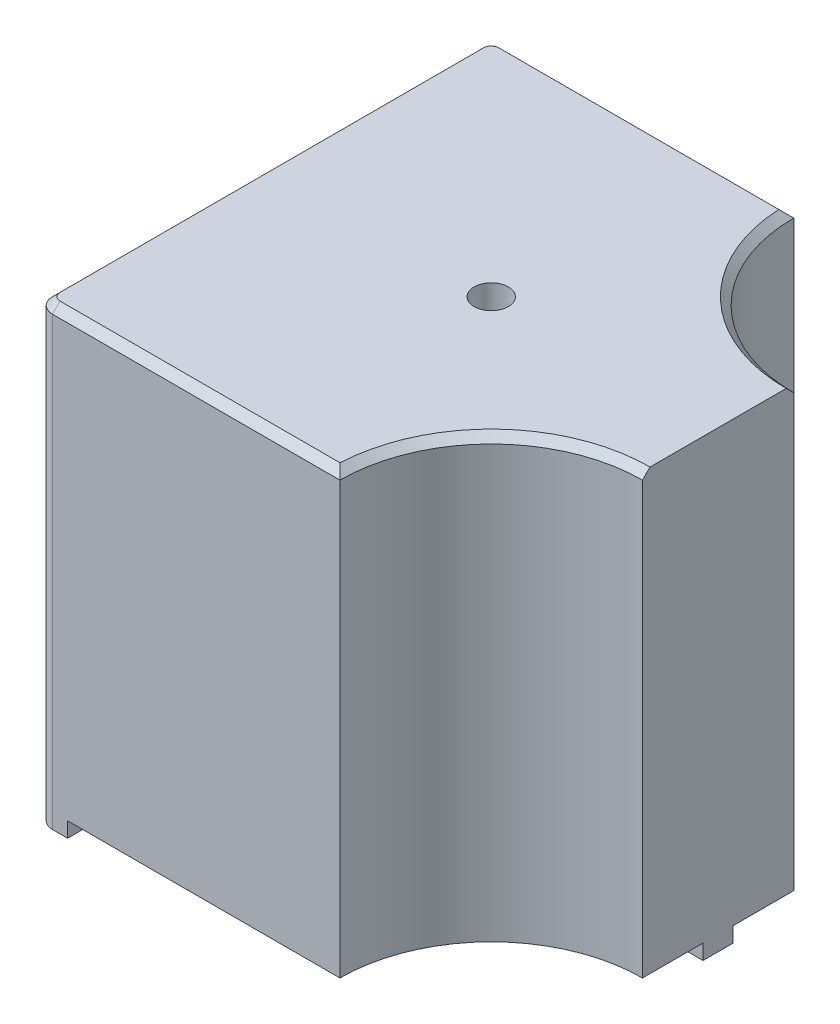
ISO-10303-21;
HEADER;
FILE_DESCRIPTION(('STEP AP214'),'2;1');
FILE_NAME('part.step','',(''),(''),'','','');
FILE_SCHEMA(('AUTOMOTIVE_DESIGN { 1 0 10303 214 1 1 1 1 }'));
ENDSEC;
DATA;
#1=APPLICATION_CONTEXT('core data for automotive mechanical design processes');
#2=APPLICATION_PROTOCOL_DEFINITION('international standard','automotive_design',2000,#1);
#3=PRODUCT_CONTEXT('',#1,'mechanical');
#4=PRODUCT('Part','Part','',(#3));
#5=PRODUCT_RELATED_PRODUCT_CATEGORY('part','',(#4));
#6=PRODUCT_DEFINITION_FORMATION('','',#4);
#7=PRODUCT_DEFINITION_CONTEXT('part definition',#1,'design');
#8=PRODUCT_DEFINITION('design','',#6,#7);
#9=PRODUCT_DEFINITION_SHAPE('','',#8);
#10=(LENGTH_UNIT() NAMED_UNIT(*) SI_UNIT(.MILLI.,.METRE.));
#11=(NAMED_UNIT(*) PLANE_ANGLE_UNIT() SI_UNIT($,.RADIAN.));
#12=(NAMED_UNIT(*) SI_UNIT($,.STERADIAN.) SOLID_ANGLE_UNIT());
#13=UNCERTAINTY_MEASURE_WITH_UNIT(LENGTH_MEASURE(1.E-05),#10,'distance_accuracy_value','');
#14=(GEOMETRIC_REPRESENTATION_CONTEXT(3) GLOBAL_UNCERTAINTY_ASSIGNED_CONTEXT((#13)) GLOBAL_UNIT_ASSIGNED_CONTEXT((#10,
#11,#12)) REPRESENTATION_CONTEXT('',''));
#15=CARTESIAN_POINT('',(0.,0.,0.));
#16=DIRECTION('',(0.,0.,1.));
#17=DIRECTION('',(1.,0.,0.));
#18=AXIS2_PLACEMENT_3D('',#15,#16,#17);
#19=CARTESIAN_POINT('',(15.,30.,-15.));
#20=DIRECTION('',(-1.,0.,0.));
#21=DIRECTION('',(0.,0.,1.));
#22=AXIS2_PLACEMENT_3D('',#19,#20,#21);
#23=PLANE('',#22);
#24=DIRECTION('',(0.,-1.,0.));
#25=VECTOR('',#24,1.);
#26=CARTESIAN_POINT('',(15.,132.451905283833,-5.));
#27=LINE('',#26,#25);
#28=CARTESIAN_POINT('',(15.,29.5,-5.));
#29=VERTEX_POINT('',#28);
#30=CARTESIAN_POINT('',(15.,1.,-5.));
#31=VERTEX_POINT('',#30);
#32=EDGE_CURVE('E303',#29,#31,#27,.T.);
#33=ORIENTED_EDGE('',*,*,#32,.F.);
#34=DIRECTION('',(0.,0.707106781186545,0.70710678118655));
#35=VECTOR('',#34,1.);
#36=CARTESIAN_POINT('',(15.,19.5000000000001,-15.));
#37=LINE('',#36,#35);
#38=CARTESIAN_POINT('',(15.,30.,-4.5));
#39=VERTEX_POINT('',#38);
#40=EDGE_CURVE('E344',#29,#39,#37,.T.);
#41=ORIENTED_EDGE('',*,*,#40,.T.);
#42=DIRECTION('',(0.,0.,-1.));
#43=VECTOR('',#42,1.);
#44=CARTESIAN_POINT('',(15.,30.,-15.));
#45=LINE('',#44,#43);
#46=CARTESIAN_POINT('',(15.,30.,4.5));
#47=VERTEX_POINT('',#46);
#48=EDGE_CURVE('E309',#47,#39,#45,.T.);
#49=ORIENTED_EDGE('',*,*,#48,.F.);
#50=DIRECTION('',(0.,-0.707106781186547,0.707106781186548));
#51=VECTOR('',#50,1.);
#52=CARTESIAN_POINT('',(15.,19.5,15.));
#53=LINE('',#52,#51);
#54=CARTESIAN_POINT('',(15.,29.5,5.));
#55=VERTEX_POINT('',#54);
#56=EDGE_CURVE('E342',#47,#55,#53,.T.);
#57=ORIENTED_EDGE('',*,*,#56,.T.);
#58=DIRECTION('',(0.,-1.,0.));
#59=VECTOR('',#58,1.);
#60=CARTESIAN_POINT('',(15.,132.451905283833,5.));
#61=LINE('',#60,#59);
#62=CARTESIAN_POINT('',(15.,1.00000000000006,5.));
#63=VERTEX_POINT('',#62);
#64=EDGE_CURVE('E300',#55,#63,#61,.T.);
#65=ORIENTED_EDGE('',*,*,#64,.T.);
#66=DIRECTION('',(0.,0.,1.));
#67=VECTOR('',#66,1.);
#68=CARTESIAN_POINT('',(15.,1.,-15.));
#69=LINE('',#68,#67);
#70=CARTESIAN_POINT('',(15.,1.,1.));
#71=VERTEX_POINT('',#70);
#72=EDGE_CURVE('E288',#71,#63,#69,.T.);
#73=ORIENTED_EDGE('',*,*,#72,.F.);
#74=DIRECTION('',(0.,-1.,0.));
#75=VECTOR('',#74,1.);
#76=CARTESIAN_POINT('',(15.,1.,1.));
#77=LINE('',#76,#75);
#78=CARTESIAN_POINT('',(15.,0.,1.));
#79=VERTEX_POINT('',#78);
#80=EDGE_CURVE('E230',#71,#79,#77,.T.);
#81=ORIENTED_EDGE('',*,*,#80,.T.);
#82=DIRECTION('',(0.,0.,-1.));
#83=VECTOR('',#82,1.);
#84=CARTESIAN_POINT('',(15.,0.,-15.));
#85=LINE('',#84,#83);
#86=CARTESIAN_POINT('',(15.,0.,-0.999999999999997));
#87=VERTEX_POINT('',#86);
#88=EDGE_CURVE('E307',#79,#87,#85,.T.);
#89=ORIENTED_EDGE('',*,*,#88,.T.);
#90=DIRECTION('',(0.,-1.,0.));
#91=VECTOR('',#90,1.);
#92=CARTESIAN_POINT('',(15.,1.,-0.999999999999997));
#93=LINE('',#92,#91);
#94=CARTESIAN_POINT('',(15.,1.,-0.999999999999997));
#95=VERTEX_POINT('',#94);
#96=EDGE_CURVE('E238',#95,#87,#93,.T.);
#97=ORIENTED_EDGE('',*,*,#96,.F.);
#98=EDGE_CURVE('E292',#31,#95,#69,.T.);
#99=ORIENTED_EDGE('',*,*,#98,.F.);
#100=EDGE_LOOP('',(#33,#41,#49,#57,#65,#73,#81,#89,#97,#99));
#101=FACE_BOUND('',#100,.T.);
#102=ADVANCED_FACE('F41',(#101),#23,.F.);
#103=CARTESIAN_POINT('',(0.,0.,0.));
#104=DIRECTION('',(0.,1.,0.));
#105=DIRECTION('',(0.,0.,1.));
#106=AXIS2_PLACEMENT_3D('',#103,#104,#105);
#107=PLANE('',#106);
#108=DIRECTION('',(1.,0.,0.));
#109=VECTOR('',#108,1.);
#110=CARTESIAN_POINT('',(-15.,0.,15.));
#111=LINE('',#110,#109);
#112=CARTESIAN_POINT('',(-13.999999968,0.,15.));
#113=VERTEX_POINT('',#112);
#114=CARTESIAN_POINT('',(-13.,0.,15.));
#115=VERTEX_POINT('',#114);
#116=EDGE_CURVE('E313',#113,#115,#111,.T.);
#117=ORIENTED_EDGE('',*,*,#116,.F.);
#118=CARTESIAN_POINT('',(-13.999999968,0.,13.999999968));
#119=DIRECTION('',(0.,1.,0.));
#120=DIRECTION('',(0.,0.,1.));
#121=AXIS2_PLACEMENT_3D('',#118,#119,#120);
#122=CIRCLE('',#121,1.000000032);
#123=CARTESIAN_POINT('',(-15.,0.,13.999999968));
#124=VERTEX_POINT('',#123);
#125=EDGE_CURVE('E327',#113,#124,#122,.F.);
#126=ORIENTED_EDGE('',*,*,#125,.T.);
#127=DIRECTION('',(0.,0.,1.));
#128=VECTOR('',#127,1.);
#129=CARTESIAN_POINT('',(-15.,0.,-15.));
#130=LINE('',#129,#128);
#131=CARTESIAN_POINT('',(-15.,0.,13.));
#132=VERTEX_POINT('',#131);
#133=EDGE_CURVE('E319',#132,#124,#130,.T.);
#134=ORIENTED_EDGE('',*,*,#133,.F.);
#135=DIRECTION('',(1.,0.,0.));
#136=VECTOR('',#135,1.);
#137=CARTESIAN_POINT('',(-15.,0.,13.));
#138=LINE('',#137,#136);
#139=CARTESIAN_POINT('',(-13.,0.,13.));
#140=VERTEX_POINT('',#139);
#141=EDGE_CURVE('E262',#132,#140,#138,.T.);
#142=ORIENTED_EDGE('',*,*,#141,.T.);
#143=DIRECTION('',(0.,0.,1.));
#144=VECTOR('',#143,1.);
#145=CARTESIAN_POINT('',(-13.,0.,15.));
#146=LINE('',#145,#144);
#147=EDGE_CURVE('E271',#140,#115,#146,.T.);
#148=ORIENTED_EDGE('',*,*,#147,.T.);
#149=EDGE_LOOP('',(#117,#126,#134,#142,#148));
#150=FACE_BOUND('',#149,.T.);
#151=ADVANCED_FACE('F409',(#150),#107,.F.);
#152=CARTESIAN_POINT('',(-15.,0.,-13.999999968));
#153=VERTEX_POINT('',#152);
#154=CARTESIAN_POINT('',(-15.,0.,-13.));
#155=VERTEX_POINT('',#154);
#156=EDGE_CURVE('E320',#153,#155,#130,.T.);
#157=ORIENTED_EDGE('',*,*,#156,.F.);
#158=CARTESIAN_POINT('',(-13.999999968,0.,-13.999999968));
#159=DIRECTION('',(0.,1.,0.));
#160=DIRECTION('',(0.,0.,1.));
#161=AXIS2_PLACEMENT_3D('',#158,#159,#160);
#162=CIRCLE('',#161,1.000000032);
#163=CARTESIAN_POINT('',(-13.999999968,0.,-15.));
#164=VERTEX_POINT('',#163);
#165=EDGE_CURVE('E334',#153,#164,#162,.F.);
#166=ORIENTED_EDGE('',*,*,#165,.T.);
#167=DIRECTION('',(-1.,0.,0.));
#168=VECTOR('',#167,1.);
#169=CARTESIAN_POINT('',(-15.,0.,-15.));
#170=LINE('',#169,#168);
#171=CARTESIAN_POINT('',(-13.,0.,-15.));
#172=VERTEX_POINT('',#171);
#173=EDGE_CURVE('E316',#172,#164,#170,.T.);
#174=ORIENTED_EDGE('',*,*,#173,.F.);
#175=DIRECTION('',(0.,0.,1.));
#176=VECTOR('',#175,1.);
#177=CARTESIAN_POINT('',(-13.,0.,-15.));
#178=LINE('',#177,#176);
#179=CARTESIAN_POINT('',(-13.,0.,-13.));
#180=VERTEX_POINT('',#179);
#181=EDGE_CURVE('E240',#172,#180,#178,.T.);
#182=ORIENTED_EDGE('',*,*,#181,.T.);
#183=DIRECTION('',(-1.,0.,0.));
#184=VECTOR('',#183,1.);
#185=CARTESIAN_POINT('',(-15.,0.,-13.));
#186=LINE('',#185,#184);
#187=EDGE_CURVE('E251',#180,#155,#186,.T.);
#188=ORIENTED_EDGE('',*,*,#187,.T.);
#189=EDGE_LOOP('',(#157,#166,#174,#182,#188));
#190=FACE_BOUND('',#189,.T.);
#191=ADVANCED_FACE('F415',(#190),#107,.F.);
#192=DIRECTION('',(1.,0.,0.));
#193=VECTOR('',#192,1.);
#194=CARTESIAN_POINT('',(15.,0.,-0.999999999999997));
#195=LINE('',#194,#193);
#196=CARTESIAN_POINT('',(13.,0.,-0.999999999999998));
#197=VERTEX_POINT('',#196);
#198=EDGE_CURVE('E224',#197,#87,#195,.T.);
#199=ORIENTED_EDGE('',*,*,#198,.T.);
#200=ORIENTED_EDGE('',*,*,#88,.F.);
#201=DIRECTION('',(-1.,0.,0.));
#202=VECTOR('',#201,1.);
#203=CARTESIAN_POINT('',(15.,0.,1.));
#204=LINE('',#203,#202);
#205=CARTESIAN_POINT('',(13.,0.,1.));
#206=VERTEX_POINT('',#205);
#207=EDGE_CURVE('E219',#79,#206,#204,.T.);
#208=ORIENTED_EDGE('',*,*,#207,.T.);
#209=DIRECTION('',(0.,0.,-1.));
#210=VECTOR('',#209,1.);
#211=CARTESIAN_POINT('',(13.,0.,1.));
#212=LINE('',#211,#210);
#213=EDGE_CURVE('E233',#206,#197,#212,.T.);
#214=ORIENTED_EDGE('',*,*,#213,.T.);
#215=EDGE_LOOP('',(#199,#200,#208,#214));
#216=FACE_BOUND('',#215,.T.);
#217=ADVANCED_FACE('F418',(#216),#107,.F.);
#218=CARTESIAN_POINT('',(-15.,30.,-15.));
#219=DIRECTION('',(0.,0.,1.));
#220=DIRECTION('',(1.,0.,0.));
#221=AXIS2_PLACEMENT_3D('',#218,#219,#220);
#222=PLANE('',#221);
#223=DIRECTION('',(0.,-1.,0.));
#224=VECTOR('',#223,1.);
#225=CARTESIAN_POINT('',(-13.999999968,30.,-15.));
#226=LINE('',#225,#224);
#227=CARTESIAN_POINT('',(-13.999999968,29.5,-15.));
#228=VERTEX_POINT('',#227);
#229=EDGE_CURVE('E336',#164,#228,#226,.F.);
#230=ORIENTED_EDGE('',*,*,#229,.T.);
#231=DIRECTION('',(1.,0.,0.));
#232=VECTOR('',#231,1.);
#233=CARTESIAN_POINT('',(5.,29.5,-15.));
#234=LINE('',#233,#232);
#235=CARTESIAN_POINT('',(5.,29.5,-15.));
#236=VERTEX_POINT('',#235);
#237=EDGE_CURVE('E360',#228,#236,#234,.T.);
#238=ORIENTED_EDGE('',*,*,#237,.T.);
#239=DIRECTION('',(0.,-1.,0.));
#240=VECTOR('',#239,1.);
#241=CARTESIAN_POINT('',(5.,132.451905283833,-15.));
#242=LINE('',#241,#240);
#243=CARTESIAN_POINT('',(5.,1.,-15.));
#244=VERTEX_POINT('',#243);
#245=EDGE_CURVE('E305',#236,#244,#242,.T.);
#246=ORIENTED_EDGE('',*,*,#245,.T.);
#247=DIRECTION('',(1.,0.,0.));
#248=VECTOR('',#247,1.);
#249=CARTESIAN_POINT('',(-15.,1.,-15.));
#250=LINE('',#249,#248);
#251=CARTESIAN_POINT('',(-13.,1.,-15.));
#252=VERTEX_POINT('',#251);
#253=EDGE_CURVE('E295',#252,#244,#250,.T.);
#254=ORIENTED_EDGE('',*,*,#253,.F.);
#255=DIRECTION('',(0.,-1.,0.));
#256=VECTOR('',#255,1.);
#257=CARTESIAN_POINT('',(-13.,1.,-15.));
#258=LINE('',#257,#256);
#259=EDGE_CURVE('E254',#252,#172,#258,.T.);
#260=ORIENTED_EDGE('',*,*,#259,.T.);
#261=ORIENTED_EDGE('',*,*,#173,.T.);
#262=EDGE_LOOP('',(#230,#238,#246,#254,#260,#261));
#263=FACE_BOUND('',#262,.T.);
#264=ADVANCED_FACE('F422',(#263),#222,.F.);
#265=CARTESIAN_POINT('',(15.,132.451905283833,-15.));
#266=DIRECTION('',(0.,-1.,0.));
#267=DIRECTION('',(0.,0.,-1.));
#268=AXIS2_PLACEMENT_3D('',#265,#266,#267);
#269=CYLINDRICAL_SURFACE('',#268,10.);
#270=ORIENTED_EDGE('',*,*,#245,.F.);
#271=CARTESIAN_POINT('',(15.,29.5,-15.));
#272=DIRECTION('',(0.,1.,0.));
#273=DIRECTION('',(0.,0.,1.));
#274=AXIS2_PLACEMENT_3D('',#271,#272,#273);
#275=CIRCLE('',#274,10.);
#276=EDGE_CURVE('E339',#236,#29,#275,.T.);
#277=ORIENTED_EDGE('',*,*,#276,.T.);
#278=ORIENTED_EDGE('',*,*,#32,.T.);
#279=CARTESIAN_POINT('',(15.,1.,-15.));
#280=DIRECTION('',(0.,-1.,0.));
#281=DIRECTION('',(0.,0.,-1.));
#282=AXIS2_PLACEMENT_3D('',#279,#280,#281);
#283=CIRCLE('',#282,10.);
#284=EDGE_CURVE('E291',#244,#31,#283,.F.);
#285=ORIENTED_EDGE('',*,*,#284,.F.);
#286=EDGE_LOOP('',(#270,#277,#278,#285));
#287=FACE_BOUND('',#286,.T.);
#288=ADVANCED_FACE('F457',(#287),#269,.F.);
#289=CARTESIAN_POINT('',(15.,132.451905283833,15.));
#290=DIRECTION('',(0.,-1.,0.));
#291=DIRECTION('',(0.,0.,-1.));
#292=AXIS2_PLACEMENT_3D('',#289,#290,#291);
#293=CYLINDRICAL_SURFACE('',#292,10.);
#294=ORIENTED_EDGE('',*,*,#64,.F.);
#295=CARTESIAN_POINT('',(15.,29.5,15.));
#296=DIRECTION('',(0.,1.,0.));
#297=DIRECTION('',(0.,0.,1.));
#298=AXIS2_PLACEMENT_3D('',#295,#296,#297);
#299=CIRCLE('',#298,10.);
#300=CARTESIAN_POINT('',(5.,29.5,15.));
#301=VERTEX_POINT('',#300);
#302=EDGE_CURVE('E54',#55,#301,#299,.T.);
#303=ORIENTED_EDGE('',*,*,#302,.T.);
#304=DIRECTION('',(0.,-1.,0.));
#305=VECTOR('',#304,1.);
#306=CARTESIAN_POINT('',(5.,132.451905283833,15.));
#307=LINE('',#306,#305);
#308=CARTESIAN_POINT('',(5.,1.,15.));
#309=VERTEX_POINT('',#308);
#310=EDGE_CURVE('E301',#301,#309,#307,.T.);
#311=ORIENTED_EDGE('',*,*,#310,.T.);
#312=CARTESIAN_POINT('',(15.,1.,15.));
#313=DIRECTION('',(0.,-1.,0.));
#314=DIRECTION('',(0.,0.,-1.));
#315=AXIS2_PLACEMENT_3D('',#312,#313,#314);
#316=CIRCLE('',#315,10.);
#317=EDGE_CURVE('E312',#309,#63,#316,.T.);
#318=ORIENTED_EDGE('',*,*,#317,.T.);
#319=EDGE_LOOP('',(#294,#303,#311,#318));
#320=FACE_BOUND('',#319,.T.);
#321=ADVANCED_FACE('F478',(#320),#293,.F.);
#322=CARTESIAN_POINT('',(-15.,30.,15.));
#323=DIRECTION('',(0.,0.,-1.));
#324=DIRECTION('',(-1.,0.,0.));
#325=AXIS2_PLACEMENT_3D('',#322,#323,#324);
#326=PLANE('',#325);
#327=ORIENTED_EDGE('',*,*,#310,.F.);
#328=DIRECTION('',(-1.,0.,0.));
#329=VECTOR('',#328,1.);
#330=CARTESIAN_POINT('',(-13.999999968,29.5,15.));
#331=LINE('',#330,#329);
#332=CARTESIAN_POINT('',(-13.999999968,29.5,15.));
#333=VERTEX_POINT('',#332);
#334=EDGE_CURVE('E12',#301,#333,#331,.T.);
#335=ORIENTED_EDGE('',*,*,#334,.T.);
#336=DIRECTION('',(0.,-1.,0.));
#337=VECTOR('',#336,1.);
#338=CARTESIAN_POINT('',(-13.999999968,30.,15.));
#339=LINE('',#338,#337);
#340=EDGE_CURVE('E325',#333,#113,#339,.T.);
#341=ORIENTED_EDGE('',*,*,#340,.T.);
#342=ORIENTED_EDGE('',*,*,#116,.T.);
#343=DIRECTION('',(0.,-1.,0.));
#344=VECTOR('',#343,1.);
#345=CARTESIAN_POINT('',(-13.,1.,15.));
#346=LINE('',#345,#344);
#347=CARTESIAN_POINT('',(-13.,1.,15.));
#348=VERTEX_POINT('',#347);
#349=EDGE_CURVE('E279',#348,#115,#346,.T.);
#350=ORIENTED_EDGE('',*,*,#349,.F.);
#351=DIRECTION('',(-1.,0.,0.));
#352=VECTOR('',#351,1.);
#353=CARTESIAN_POINT('',(-15.,1.,15.));
#354=LINE('',#353,#352);
#355=EDGE_CURVE('E282',#309,#348,#354,.T.);
#356=ORIENTED_EDGE('',*,*,#355,.F.);
#357=EDGE_LOOP('',(#327,#335,#341,#342,#350,#356));
#358=FACE_BOUND('',#357,.T.);
#359=ADVANCED_FACE('F497',(#358),#326,.F.);
#360=CARTESIAN_POINT('',(0.,30.,0.));
#361=DIRECTION('',(0.,1.,0.));
#362=DIRECTION('',(0.,0.,1.));
#363=AXIS2_PLACEMENT_3D('',#360,#361,#362);
#364=PLANE('',#363);
#365=ORIENTED_EDGE('',*,*,#48,.T.);
#366=CARTESIAN_POINT('',(15.,30.,-15.));
#367=DIRECTION('',(0.,1.,0.));
#368=DIRECTION('',(0.,0.,1.));
#369=AXIS2_PLACEMENT_3D('',#366,#367,#368);
#370=CIRCLE('',#369,10.5);
#371=CARTESIAN_POINT('',(4.51191151829848,30.,-14.5));
#372=VERTEX_POINT('',#371);
#373=EDGE_CURVE('E358',#39,#372,#370,.F.);
#374=ORIENTED_EDGE('',*,*,#373,.T.);
#375=DIRECTION('',(-1.,0.,0.));
#376=VECTOR('',#375,1.);
#377=CARTESIAN_POINT('',(-13.999999968,30.,-14.5));
#378=LINE('',#377,#376);
#379=CARTESIAN_POINT('',(-13.999999968,30.,-14.5));
#380=VERTEX_POINT('',#379);
#381=EDGE_CURVE('E356',#372,#380,#378,.T.);
#382=ORIENTED_EDGE('',*,*,#381,.T.);
#383=CARTESIAN_POINT('',(-13.999999968,30.,-13.999999968));
#384=DIRECTION('',(0.,1.,0.));
#385=DIRECTION('',(0.,0.,1.));
#386=AXIS2_PLACEMENT_3D('',#383,#384,#385);
#387=CIRCLE('',#386,0.500000032);
#388=CARTESIAN_POINT('',(-14.5,30.,-13.999999968));
#389=VERTEX_POINT('',#388);
#390=EDGE_CURVE('E354',#380,#389,#387,.T.);
#391=ORIENTED_EDGE('',*,*,#390,.T.);
#392=DIRECTION('',(0.,0.,1.));
#393=VECTOR('',#392,1.);
#394=CARTESIAN_POINT('',(-14.5,30.,13.999999968));
#395=LINE('',#394,#393);
#396=CARTESIAN_POINT('',(-14.5,30.,13.999999968));
#397=VERTEX_POINT('',#396);
#398=EDGE_CURVE('E352',#389,#397,#395,.T.);
#399=ORIENTED_EDGE('',*,*,#398,.T.);
#400=CARTESIAN_POINT('',(-13.999999968,30.,13.999999968));
#401=DIRECTION('',(0.,1.,0.));
#402=DIRECTION('',(0.,0.,1.));
#403=AXIS2_PLACEMENT_3D('',#400,#401,#402);
#404=CIRCLE('',#403,0.500000032);
#405=CARTESIAN_POINT('',(-13.999999968,30.,14.5));
#406=VERTEX_POINT('',#405);
#407=EDGE_CURVE('E350',#397,#406,#404,.T.);
#408=ORIENTED_EDGE('',*,*,#407,.T.);
#409=DIRECTION('',(1.,0.,0.));
#410=VECTOR('',#409,1.);
#411=CARTESIAN_POINT('',(5.,30.,14.5));
#412=LINE('',#411,#410);
#413=CARTESIAN_POINT('',(4.51191151829848,30.,14.5));
#414=VERTEX_POINT('',#413);
#415=EDGE_CURVE('E346',#406,#414,#412,.T.);
#416=ORIENTED_EDGE('',*,*,#415,.T.);
#417=CARTESIAN_POINT('',(15.,30.,15.));
#418=DIRECTION('',(0.,1.,0.));
#419=DIRECTION('',(0.,0.,1.));
#420=AXIS2_PLACEMENT_3D('',#417,#418,#419);
#421=CIRCLE('',#420,10.5);
#422=EDGE_CURVE('E348',#414,#47,#421,.F.);
#423=ORIENTED_EDGE('',*,*,#422,.T.);
#424=EDGE_LOOP('',(#365,#374,#382,#391,#399,#408,#416,#423));
#425=FACE_BOUND('',#424,.T.);
#426=CARTESIAN_POINT('',(0.,30.,0.));
#427=DIRECTION('',(0.,1.,0.));
#428=DIRECTION('',(0.,0.,1.));
#429=AXIS2_PLACEMENT_3D('',#426,#427,#428);
#430=CIRCLE('',#429,1.1303);
#431=CARTESIAN_POINT('',(0.,30.,1.1303));
#432=VERTEX_POINT('',#431);
#433=EDGE_CURVE('E209',#432,#432,#430,.T.);
#434=ORIENTED_EDGE('',*,*,#433,.F.);
#435=EDGE_LOOP('',(#434));
#436=FACE_BOUND('',#435,.T.);
#437=ADVANCED_FACE('F536',(#425,#436),#364,.T.);
#438=CARTESIAN_POINT('',(-15.,30.,-15.));
#439=DIRECTION('',(1.,0.,0.));
#440=DIRECTION('',(0.,0.,-1.));
#441=AXIS2_PLACEMENT_3D('',#438,#439,#440);
#442=PLANE('',#441);
#443=DIRECTION('',(0.,-1.,0.));
#444=VECTOR('',#443,1.);
#445=CARTESIAN_POINT('',(-15.,30.,13.999999968));
#446=LINE('',#445,#444);
#447=CARTESIAN_POINT('',(-15.,29.5,13.999999968));
#448=VERTEX_POINT('',#447);
#449=EDGE_CURVE('E331',#124,#448,#446,.F.);
#450=ORIENTED_EDGE('',*,*,#449,.T.);
#451=DIRECTION('',(0.,0.,-1.));
#452=VECTOR('',#451,1.);
#453=CARTESIAN_POINT('',(-15.,29.5,-13.999999968));
#454=LINE('',#453,#452);
#455=CARTESIAN_POINT('',(-15.,29.5,-13.999999968));
#456=VERTEX_POINT('',#455);
#457=EDGE_CURVE('E364',#448,#456,#454,.T.);
#458=ORIENTED_EDGE('',*,*,#457,.T.);
#459=DIRECTION('',(0.,-1.,0.));
#460=VECTOR('',#459,1.);
#461=CARTESIAN_POINT('',(-15.,30.,-13.999999968));
#462=LINE('',#461,#460);
#463=EDGE_CURVE('E329',#456,#153,#462,.T.);
#464=ORIENTED_EDGE('',*,*,#463,.T.);
#465=ORIENTED_EDGE('',*,*,#156,.T.);
#466=DIRECTION('',(0.,-1.,0.));
#467=VECTOR('',#466,1.);
#468=CARTESIAN_POINT('',(-15.,1.,-13.));
#469=LINE('',#468,#467);
#470=CARTESIAN_POINT('',(-15.,1.,-13.));
#471=VERTEX_POINT('',#470);
#472=EDGE_CURVE('E259',#471,#155,#469,.T.);
#473=ORIENTED_EDGE('',*,*,#472,.F.);
#474=DIRECTION('',(0.,0.,-1.));
#475=VECTOR('',#474,1.);
#476=CARTESIAN_POINT('',(-15.,1.,-15.));
#477=LINE('',#476,#475);
#478=CARTESIAN_POINT('',(-15.,1.,13.));
#479=VERTEX_POINT('',#478);
#480=EDGE_CURVE('E298',#479,#471,#477,.T.);
#481=ORIENTED_EDGE('',*,*,#480,.F.);
#482=DIRECTION('',(0.,-1.,0.));
#483=VECTOR('',#482,1.);
#484=CARTESIAN_POINT('',(-15.,1.,13.));
#485=LINE('',#484,#483);
#486=EDGE_CURVE('E274',#479,#132,#485,.T.);
#487=ORIENTED_EDGE('',*,*,#486,.T.);
#488=ORIENTED_EDGE('',*,*,#133,.T.);
#489=EDGE_LOOP('',(#450,#458,#464,#465,#473,#481,#487,#488));
#490=FACE_BOUND('',#489,.T.);
#491=ADVANCED_FACE('F491',(#490),#442,.F.);
#492=CARTESIAN_POINT('',(0.,1.,0.));
#493=DIRECTION('',(0.,-1.,0.));
#494=DIRECTION('',(0.,0.,-1.));
#495=AXIS2_PLACEMENT_3D('',#492,#493,#494);
#496=PLANE('',#495);
#497=CARTESIAN_POINT('',(0.,1.,0.));
#498=DIRECTION('',(0.,-1.,0.));
#499=DIRECTION('',(0.,0.,-1.));
#500=AXIS2_PLACEMENT_3D('',#497,#498,#499);
#501=CIRCLE('',#500,1.7272);
#502=CARTESIAN_POINT('',(0.,1.,-1.7272));
#503=VERTEX_POINT('',#502);
#504=EDGE_CURVE('E208',#503,#503,#501,.T.);
#505=ORIENTED_EDGE('',*,*,#504,.F.);
#506=EDGE_LOOP('',(#505));
#507=FACE_BOUND('',#506,.T.);
#508=ORIENTED_EDGE('',*,*,#480,.T.);
#509=DIRECTION('',(-1.,0.,0.));
#510=VECTOR('',#509,1.);
#511=CARTESIAN_POINT('',(-15.,1.,-13.));
#512=LINE('',#511,#510);
#513=CARTESIAN_POINT('',(-13.,1.,-13.));
#514=VERTEX_POINT('',#513);
#515=EDGE_CURVE('E250',#514,#471,#512,.T.);
#516=ORIENTED_EDGE('',*,*,#515,.F.);
#517=DIRECTION('',(0.,0.,1.));
#518=VECTOR('',#517,1.);
#519=CARTESIAN_POINT('',(-13.,1.,-15.));
#520=LINE('',#519,#518);
#521=EDGE_CURVE('E247',#252,#514,#520,.T.);
#522=ORIENTED_EDGE('',*,*,#521,.F.);
#523=ORIENTED_EDGE('',*,*,#253,.T.);
#524=ORIENTED_EDGE('',*,*,#284,.T.);
#525=ORIENTED_EDGE('',*,*,#98,.T.);
#526=DIRECTION('',(1.,0.,0.));
#527=VECTOR('',#526,1.);
#528=CARTESIAN_POINT('',(15.,1.,-0.999999999999997));
#529=LINE('',#528,#527);
#530=CARTESIAN_POINT('',(13.,1.,-0.999999999999998));
#531=VERTEX_POINT('',#530);
#532=EDGE_CURVE('E227',#531,#95,#529,.T.);
#533=ORIENTED_EDGE('',*,*,#532,.F.);
#534=DIRECTION('',(0.,0.,-1.));
#535=VECTOR('',#534,1.);
#536=CARTESIAN_POINT('',(13.,1.,1.));
#537=LINE('',#536,#535);
#538=CARTESIAN_POINT('',(13.,1.,1.));
#539=VERTEX_POINT('',#538);
#540=EDGE_CURVE('E223',#539,#531,#537,.T.);
#541=ORIENTED_EDGE('',*,*,#540,.F.);
#542=DIRECTION('',(-1.,0.,0.));
#543=VECTOR('',#542,1.);
#544=CARTESIAN_POINT('',(15.,1.,1.));
#545=LINE('',#544,#543);
#546=EDGE_CURVE('E220',#71,#539,#545,.T.);
#547=ORIENTED_EDGE('',*,*,#546,.F.);
#548=ORIENTED_EDGE('',*,*,#72,.T.);
#549=ORIENTED_EDGE('',*,*,#317,.F.);
#550=ORIENTED_EDGE('',*,*,#355,.T.);
#551=DIRECTION('',(0.,0.,1.));
#552=VECTOR('',#551,1.);
#553=CARTESIAN_POINT('',(-13.,1.,15.));
#554=LINE('',#553,#552);
#555=CARTESIAN_POINT('',(-13.,1.,13.));
#556=VERTEX_POINT('',#555);
#557=EDGE_CURVE('E270',#556,#348,#554,.T.);
#558=ORIENTED_EDGE('',*,*,#557,.F.);
#559=DIRECTION('',(1.,0.,0.));
#560=VECTOR('',#559,1.);
#561=CARTESIAN_POINT('',(-15.,1.,13.));
#562=LINE('',#561,#560);
#563=EDGE_CURVE('E267',#479,#556,#562,.T.);
#564=ORIENTED_EDGE('',*,*,#563,.F.);
#565=EDGE_LOOP('',(#508,#516,#522,#523,#524,#525,#533,#541,#547,#548,#549,#550,#558,#564));
#566=FACE_BOUND('',#565,.T.);
#567=ADVANCED_FACE('F460',(#507,#566),#496,.T.);
#568=CARTESIAN_POINT('',(-13.,1.,15.));
#569=DIRECTION('',(1.,0.,0.));
#570=DIRECTION('',(0.,0.,-1.));
#571=AXIS2_PLACEMENT_3D('',#568,#569,#570);
#572=PLANE('',#571);
#573=ORIENTED_EDGE('',*,*,#147,.F.);
#574=DIRECTION('',(0.,-1.,0.));
#575=VECTOR('',#574,1.);
#576=CARTESIAN_POINT('',(-13.,1.,13.));
#577=LINE('',#576,#575);
#578=EDGE_CURVE('E283',#556,#140,#577,.T.);
#579=ORIENTED_EDGE('',*,*,#578,.F.);
#580=ORIENTED_EDGE('',*,*,#557,.T.);
#581=ORIENTED_EDGE('',*,*,#349,.T.);
#582=EDGE_LOOP('',(#573,#579,#580,#581));
#583=FACE_BOUND('',#582,.T.);
#584=ADVANCED_FACE('F500',(#583),#572,.T.);
#585=CARTESIAN_POINT('',(-15.,1.,13.));
#586=DIRECTION('',(0.,0.,-1.));
#587=DIRECTION('',(-1.,0.,0.));
#588=AXIS2_PLACEMENT_3D('',#585,#586,#587);
#589=PLANE('',#588);
#590=ORIENTED_EDGE('',*,*,#141,.F.);
#591=ORIENTED_EDGE('',*,*,#486,.F.);
#592=ORIENTED_EDGE('',*,*,#563,.T.);
#593=ORIENTED_EDGE('',*,*,#578,.T.);
#594=EDGE_LOOP('',(#590,#591,#592,#593));
#595=FACE_BOUND('',#594,.T.);
#596=ADVANCED_FACE('F521',(#595),#589,.T.);
#597=CARTESIAN_POINT('',(-15.,1.,-13.));
#598=DIRECTION('',(0.,0.,1.));
#599=DIRECTION('',(1.,0.,0.));
#600=AXIS2_PLACEMENT_3D('',#597,#598,#599);
#601=PLANE('',#600);
#602=ORIENTED_EDGE('',*,*,#187,.F.);
#603=DIRECTION('',(0.,-1.,0.));
#604=VECTOR('',#603,1.);
#605=CARTESIAN_POINT('',(-13.,1.,-13.));
#606=LINE('',#605,#604);
#607=EDGE_CURVE('E263',#514,#180,#606,.T.);
#608=ORIENTED_EDGE('',*,*,#607,.F.);
#609=ORIENTED_EDGE('',*,*,#515,.T.);
#610=ORIENTED_EDGE('',*,*,#472,.T.);
#611=EDGE_LOOP('',(#602,#608,#609,#610));
#612=FACE_BOUND('',#611,.T.);
#613=ADVANCED_FACE('F508',(#612),#601,.T.);
#614=CARTESIAN_POINT('',(-13.,1.,-15.));
#615=DIRECTION('',(1.,0.,0.));
#616=DIRECTION('',(0.,0.,-1.));
#617=AXIS2_PLACEMENT_3D('',#614,#615,#616);
#618=PLANE('',#617);
#619=ORIENTED_EDGE('',*,*,#181,.F.);
#620=ORIENTED_EDGE('',*,*,#259,.F.);
#621=ORIENTED_EDGE('',*,*,#521,.T.);
#622=ORIENTED_EDGE('',*,*,#607,.T.);
#623=EDGE_LOOP('',(#619,#620,#621,#622));
#624=FACE_BOUND('',#623,.T.);
#625=ADVANCED_FACE('F513',(#624),#618,.T.);
#626=CARTESIAN_POINT('',(15.,1.,-0.999999999999997));
#627=DIRECTION('',(0.,0.,-1.));
#628=DIRECTION('',(-1.,0.,0.));
#629=AXIS2_PLACEMENT_3D('',#626,#627,#628);
#630=PLANE('',#629);
#631=ORIENTED_EDGE('',*,*,#198,.F.);
#632=DIRECTION('',(0.,-1.,0.));
#633=VECTOR('',#632,1.);
#634=CARTESIAN_POINT('',(13.,1.,-0.999999999999998));
#635=LINE('',#634,#633);
#636=EDGE_CURVE('E241',#531,#197,#635,.T.);
#637=ORIENTED_EDGE('',*,*,#636,.F.);
#638=ORIENTED_EDGE('',*,*,#532,.T.);
#639=ORIENTED_EDGE('',*,*,#96,.T.);
#640=EDGE_LOOP('',(#631,#637,#638,#639));
#641=FACE_BOUND('',#640,.T.);
#642=ADVANCED_FACE('F466',(#641),#630,.T.);
#643=CARTESIAN_POINT('',(13.,1.,1.));
#644=DIRECTION('',(-1.,0.,0.));
#645=DIRECTION('',(0.,0.,1.));
#646=AXIS2_PLACEMENT_3D('',#643,#644,#645);
#647=PLANE('',#646);
#648=ORIENTED_EDGE('',*,*,#213,.F.);
#649=DIRECTION('',(0.,-1.,0.));
#650=VECTOR('',#649,1.);
#651=CARTESIAN_POINT('',(13.,1.,1.));
#652=LINE('',#651,#650);
#653=EDGE_CURVE('E243',#539,#206,#652,.T.);
#654=ORIENTED_EDGE('',*,*,#653,.F.);
#655=ORIENTED_EDGE('',*,*,#540,.T.);
#656=ORIENTED_EDGE('',*,*,#636,.T.);
#657=EDGE_LOOP('',(#648,#654,#655,#656));
#658=FACE_BOUND('',#657,.T.);
#659=ADVANCED_FACE('F471',(#658),#647,.T.);
#660=CARTESIAN_POINT('',(15.,1.,1.));
#661=DIRECTION('',(0.,0.,1.));
#662=DIRECTION('',(1.,0.,0.));
#663=AXIS2_PLACEMENT_3D('',#660,#661,#662);
#664=PLANE('',#663);
#665=ORIENTED_EDGE('',*,*,#207,.F.);
#666=ORIENTED_EDGE('',*,*,#80,.F.);
#667=ORIENTED_EDGE('',*,*,#546,.T.);
#668=ORIENTED_EDGE('',*,*,#653,.T.);
#669=EDGE_LOOP('',(#665,#666,#667,#668));
#670=FACE_BOUND('',#669,.T.);
#671=ADVANCED_FACE('F584',(#670),#664,.T.);
#672=CARTESIAN_POINT('',(0.,11.7188,0.));
#673=DIRECTION('',(0.,-1.,0.));
#674=DIRECTION('',(0.,0.,-1.));
#675=AXIS2_PLACEMENT_3D('',#672,#673,#674);
#676=CONICAL_SURFACE('',#675,1.7272,1.02974425867665);
#677=CARTESIAN_POINT('',(0.,12.7566064611844,0.));
#678=VERTEX_POINT('',#677);
#679=VERTEX_LOOP('',#678);
#680=FACE_BOUND('',#679,.T.);
#681=CARTESIAN_POINT('',(0.,11.7188,0.));
#682=DIRECTION('',(0.,-1.,0.));
#683=DIRECTION('',(0.,0.,-1.));
#684=AXIS2_PLACEMENT_3D('',#681,#682,#683);
#685=CIRCLE('',#684,1.7272);
#686=CARTESIAN_POINT('',(0.,11.7188,-1.7272));
#687=VERTEX_POINT('',#686);
#688=EDGE_CURVE('E212',#687,#687,#685,.T.);
#689=ORIENTED_EDGE('',*,*,#688,.T.);
#690=EDGE_LOOP('',(#689));
#691=FACE_BOUND('',#690,.T.);
#692=ADVANCED_FACE('F592',(#680,#691),#676,.F.);
#693=CARTESIAN_POINT('',(0.,1.,0.));
#694=DIRECTION('',(0.,-1.,0.));
#695=DIRECTION('',(0.,0.,-1.));
#696=AXIS2_PLACEMENT_3D('',#693,#694,#695);
#697=CYLINDRICAL_SURFACE('',#696,1.7272);
#698=ORIENTED_EDGE('',*,*,#688,.F.);
#699=EDGE_LOOP('',(#698));
#700=FACE_BOUND('',#699,.T.);
#701=ORIENTED_EDGE('',*,*,#504,.T.);
#702=EDGE_LOOP('',(#701));
#703=FACE_BOUND('',#702,.T.);
#704=ADVANCED_FACE('F202',(#700,#703),#697,.F.);
#705=CARTESIAN_POINT('',(0.,22.4054,0.));
#706=DIRECTION('',(0.,1.,0.));
#707=DIRECTION('',(0.,0.,1.));
#708=AXIS2_PLACEMENT_3D('',#705,#706,#707);
#709=CONICAL_SURFACE('',#708,1.1303,1.02974425867665);
#710=CARTESIAN_POINT('',(0.,21.7262472423131,0.));
#711=VERTEX_POINT('',#710);
#712=VERTEX_LOOP('',#711);
#713=FACE_BOUND('',#712,.T.);
#714=CARTESIAN_POINT('',(0.,22.4054,0.));
#715=DIRECTION('',(0.,1.,0.));
#716=DIRECTION('',(0.,0.,1.));
#717=AXIS2_PLACEMENT_3D('',#714,#715,#716);
#718=CIRCLE('',#717,1.1303);
#719=CARTESIAN_POINT('',(0.,22.4054,1.1303));
#720=VERTEX_POINT('',#719);
#721=EDGE_CURVE('E206',#720,#720,#718,.T.);
#722=ORIENTED_EDGE('',*,*,#721,.T.);
#723=EDGE_LOOP('',(#722));
#724=FACE_BOUND('',#723,.T.);
#725=ADVANCED_FACE('F198',(#713,#724),#709,.F.);
#726=CARTESIAN_POINT('',(0.,30.,0.));
#727=DIRECTION('',(0.,1.,0.));
#728=DIRECTION('',(0.,0.,1.));
#729=AXIS2_PLACEMENT_3D('',#726,#727,#728);
#730=CYLINDRICAL_SURFACE('',#729,1.1303);
#731=ORIENTED_EDGE('',*,*,#721,.F.);
#732=EDGE_LOOP('',(#731));
#733=FACE_BOUND('',#732,.T.);
#734=ORIENTED_EDGE('',*,*,#433,.T.);
#735=EDGE_LOOP('',(#734));
#736=FACE_BOUND('',#735,.T.);
#737=ADVANCED_FACE('F201',(#733,#736),#730,.F.);
#738=CARTESIAN_POINT('',(-13.999999968,30.,13.999999968));
#739=DIRECTION('',(0.,-1.,0.));
#740=DIRECTION('',(0.,0.,-1.));
#741=AXIS2_PLACEMENT_3D('',#738,#739,#740);
#742=CYLINDRICAL_SURFACE('',#741,1.000000032);
#743=ORIENTED_EDGE('',*,*,#340,.F.);
#744=CARTESIAN_POINT('',(-13.999999968,29.5,13.999999968));
#745=DIRECTION('',(0.,1.,0.));
#746=DIRECTION('',(0.,0.,1.));
#747=AXIS2_PLACEMENT_3D('',#744,#745,#746);
#748=CIRCLE('',#747,1.000000032);
#749=EDGE_CURVE('E366',#333,#448,#748,.F.);
#750=ORIENTED_EDGE('',*,*,#749,.T.);
#751=ORIENTED_EDGE('',*,*,#449,.F.);
#752=ORIENTED_EDGE('',*,*,#125,.F.);
#753=EDGE_LOOP('',(#743,#750,#751,#752));
#754=FACE_BOUND('',#753,.T.);
#755=ADVANCED_FACE('F424',(#754),#742,.T.);
#756=CARTESIAN_POINT('',(-13.999999968,30.,-13.999999968));
#757=DIRECTION('',(0.,-1.,0.));
#758=DIRECTION('',(0.,0.,-1.));
#759=AXIS2_PLACEMENT_3D('',#756,#757,#758);
#760=CYLINDRICAL_SURFACE('',#759,1.000000032);
#761=ORIENTED_EDGE('',*,*,#463,.F.);
#762=CARTESIAN_POINT('',(-13.999999968,29.5,-13.999999968));
#763=DIRECTION('',(0.,1.,0.));
#764=DIRECTION('',(0.,0.,1.));
#765=AXIS2_PLACEMENT_3D('',#762,#763,#764);
#766=CIRCLE('',#765,1.000000032);
#767=EDGE_CURVE('E362',#456,#228,#766,.F.);
#768=ORIENTED_EDGE('',*,*,#767,.T.);
#769=ORIENTED_EDGE('',*,*,#229,.F.);
#770=ORIENTED_EDGE('',*,*,#165,.F.);
#771=EDGE_LOOP('',(#761,#768,#769,#770));
#772=FACE_BOUND('',#771,.T.);
#773=ADVANCED_FACE('F405',(#772),#760,.T.);
#774=CARTESIAN_POINT('',(15.,30.,15.));
#775=DIRECTION('',(0.,1.,0.));
#776=DIRECTION('',(0.,0.,1.));
#777=AXIS2_PLACEMENT_3D('',#774,#775,#776);
#778=CONICAL_SURFACE('',#777,10.5,0.785398163397448);
#779=ORIENTED_EDGE('',*,*,#56,.F.);
#780=ORIENTED_EDGE('',*,*,#422,.F.);
#781=CARTESIAN_POINT('',(5.,29.5,15.));
#782=CARTESIAN_POINT('',(4.91733937246074,29.5826927872178,14.9173072127821));
#783=CARTESIAN_POINT('',(4.8353349882767,29.6657058792557,14.8342941207443));
#784=CARTESIAN_POINT('',(4.67263882969526,29.8323725468916,14.6676274531084));
#785=CARTESIAN_POINT('',(4.59194705331213,29.9160261215204,14.5839738784796));
#786=CARTESIAN_POINT('',(4.51191151829848,30.,14.5));
#787=B_SPLINE_CURVE_WITH_KNOTS('',3,(#781,#782,#783,#784,#785,#786),.UNSPECIFIED.,.F.,.F.,(4,2,
4),(0.,0.429608651359532,0.85921665273988),.UNSPECIFIED.);
#788=EDGE_CURVE('E46',#301,#414,#787,.T.);
#789=ORIENTED_EDGE('',*,*,#788,.F.);
#790=ORIENTED_EDGE('',*,*,#302,.F.);
#791=EDGE_LOOP('',(#779,#780,#789,#790));
#792=FACE_BOUND('',#791,.T.);
#793=ADVANCED_FACE('F43',(#792),#778,.F.);
#794=CARTESIAN_POINT('',(0.,30.,14.5));
#795=DIRECTION('',(0.,0.707106781186542,0.707106781186552));
#796=DIRECTION('',(-1.,0.,0.));
#797=AXIS2_PLACEMENT_3D('',#794,#795,#796);
#798=PLANE('',#797);
#799=ORIENTED_EDGE('',*,*,#788,.T.);
#800=ORIENTED_EDGE('',*,*,#415,.F.);
#801=DIRECTION('',(0.,0.707106781186552,-0.707106781186542));
#802=VECTOR('',#801,1.);
#803=CARTESIAN_POINT('',(-13.999999968,29.5,15.));
#804=LINE('',#803,#802);
#805=EDGE_CURVE('E482',#333,#406,#804,.T.);
#806=ORIENTED_EDGE('',*,*,#805,.F.);
#807=ORIENTED_EDGE('',*,*,#334,.F.);
#808=EDGE_LOOP('',(#799,#800,#806,#807));
#809=FACE_BOUND('',#808,.T.);
#810=ADVANCED_FACE('F397',(#809),#798,.T.);
#811=CARTESIAN_POINT('',(-13.999999968,30.,13.999999968));
#812=DIRECTION('',(0.,-1.,0.));
#813=DIRECTION('',(0.,0.,-1.));
#814=AXIS2_PLACEMENT_3D('',#811,#812,#813);
#815=CONICAL_SURFACE('',#814,0.500000032,0.785398163397441);
#816=ORIENTED_EDGE('',*,*,#805,.T.);
#817=ORIENTED_EDGE('',*,*,#407,.F.);
#818=DIRECTION('',(0.707106781186542,0.707106781186552,0.));
#819=VECTOR('',#818,1.);
#820=CARTESIAN_POINT('',(-15.,29.5,13.999999968));
#821=LINE('',#820,#819);
#822=EDGE_CURVE('E444',#448,#397,#821,.T.);
#823=ORIENTED_EDGE('',*,*,#822,.F.);
#824=ORIENTED_EDGE('',*,*,#749,.F.);
#825=EDGE_LOOP('',(#816,#817,#823,#824));
#826=FACE_BOUND('',#825,.T.);
#827=ADVANCED_FACE('F394',(#826),#815,.T.);
#828=CARTESIAN_POINT('',(-14.5,30.,0.));
#829=DIRECTION('',(-0.707106781186552,0.707106781186542,0.));
#830=DIRECTION('',(0.,0.,-1.));
#831=AXIS2_PLACEMENT_3D('',#828,#829,#830);
#832=PLANE('',#831);
#833=ORIENTED_EDGE('',*,*,#822,.T.);
#834=ORIENTED_EDGE('',*,*,#398,.F.);
#835=DIRECTION('',(0.707106781186542,0.707106781186552,0.));
#836=VECTOR('',#835,1.);
#837=CARTESIAN_POINT('',(-15.,29.5,-13.999999968));
#838=LINE('',#837,#836);
#839=EDGE_CURVE('E441',#456,#389,#838,.T.);
#840=ORIENTED_EDGE('',*,*,#839,.F.);
#841=ORIENTED_EDGE('',*,*,#457,.F.);
#842=EDGE_LOOP('',(#833,#834,#840,#841));
#843=FACE_BOUND('',#842,.T.);
#844=ADVANCED_FACE('F390',(#843),#832,.T.);
#845=CARTESIAN_POINT('',(-13.999999968,30.,-13.999999968));
#846=DIRECTION('',(0.,-1.,0.));
#847=DIRECTION('',(0.,0.,-1.));
#848=AXIS2_PLACEMENT_3D('',#845,#846,#847);
#849=CONICAL_SURFACE('',#848,0.500000032,0.785398163397441);
#850=ORIENTED_EDGE('',*,*,#839,.T.);
#851=ORIENTED_EDGE('',*,*,#390,.F.);
#852=DIRECTION('',(0.,0.707106781186552,0.707106781186542));
#853=VECTOR('',#852,1.);
#854=CARTESIAN_POINT('',(-13.999999968,29.5,-15.));
#855=LINE('',#854,#853);
#856=EDGE_CURVE('E377',#228,#380,#855,.T.);
#857=ORIENTED_EDGE('',*,*,#856,.F.);
#858=ORIENTED_EDGE('',*,*,#767,.F.);
#859=EDGE_LOOP('',(#850,#851,#857,#858));
#860=FACE_BOUND('',#859,.T.);
#861=ADVANCED_FACE('F387',(#860),#849,.T.);
#862=CARTESIAN_POINT('',(0.,30.,-14.5));
#863=DIRECTION('',(0.,0.707106781186542,-0.707106781186552));
#864=DIRECTION('',(1.,0.,0.));
#865=AXIS2_PLACEMENT_3D('',#862,#863,#864);
#866=PLANE('',#865);
#867=ORIENTED_EDGE('',*,*,#856,.T.);
#868=ORIENTED_EDGE('',*,*,#381,.F.);
#869=CARTESIAN_POINT('',(4.51191151829848,30.,-14.5));
#870=CARTESIAN_POINT('',(4.59194705331212,29.9160261215204,-14.5839738784796));
#871=CARTESIAN_POINT('',(4.67263882969526,29.8323725468916,-14.6676274531084));
#872=CARTESIAN_POINT('',(4.8353349882767,29.6657058792557,-14.8342941207443));
#873=CARTESIAN_POINT('',(4.91733937246074,29.5826927872179,-14.9173072127821));
#874=CARTESIAN_POINT('',(5.,29.5,-15.));
#875=B_SPLINE_CURVE_WITH_KNOTS('',3,(#869,#870,#871,#872,#873,#874),.UNSPECIFIED.,.F.,.F.,(4,2,
4),(0.,0.429608001380349,0.859216652739879),.UNSPECIFIED.);
#876=EDGE_CURVE('E369',#236,#372,#875,.F.);
#877=ORIENTED_EDGE('',*,*,#876,.F.);
#878=ORIENTED_EDGE('',*,*,#237,.F.);
#879=EDGE_LOOP('',(#867,#868,#877,#878));
#880=FACE_BOUND('',#879,.T.);
#881=ADVANCED_FACE('F379',(#880),#866,.T.);
#882=CARTESIAN_POINT('',(15.,29.5,-15.));
#883=DIRECTION('',(0.,1.,0.));
#884=DIRECTION('',(0.,0.,1.));
#885=AXIS2_PLACEMENT_3D('',#882,#883,#884);
#886=CONICAL_SURFACE('',#885,10.,0.785398163397452);
#887=ORIENTED_EDGE('',*,*,#876,.T.);
#888=ORIENTED_EDGE('',*,*,#373,.F.);
#889=ORIENTED_EDGE('',*,*,#40,.F.);
#890=ORIENTED_EDGE('',*,*,#276,.F.);
#891=EDGE_LOOP('',(#887,#888,#889,#890));
#892=FACE_BOUND('',#891,.T.);
#893=ADVANCED_FACE('F382',(#892),#886,.F.);
#894=CLOSED_SHELL('',(#102,#151,#191,#217,#264,#288,#321,#359,#437,#491,#567,#584,#596,#613,
#625,#642,#659,#671,#692,#704,#725,#737,#755,#773,#793,#810,#827,#844,#861,#881,#893));
#895=MANIFOLD_SOLID_BREP('B2',#894);
#896=ADVANCED_BREP_SHAPE_REPRESENTATION('',(#18,#895),#14);
#897=SHAPE_DEFINITION_REPRESENTATION(#9,#896);
ENDSEC;
END-ISO-10303-21;
